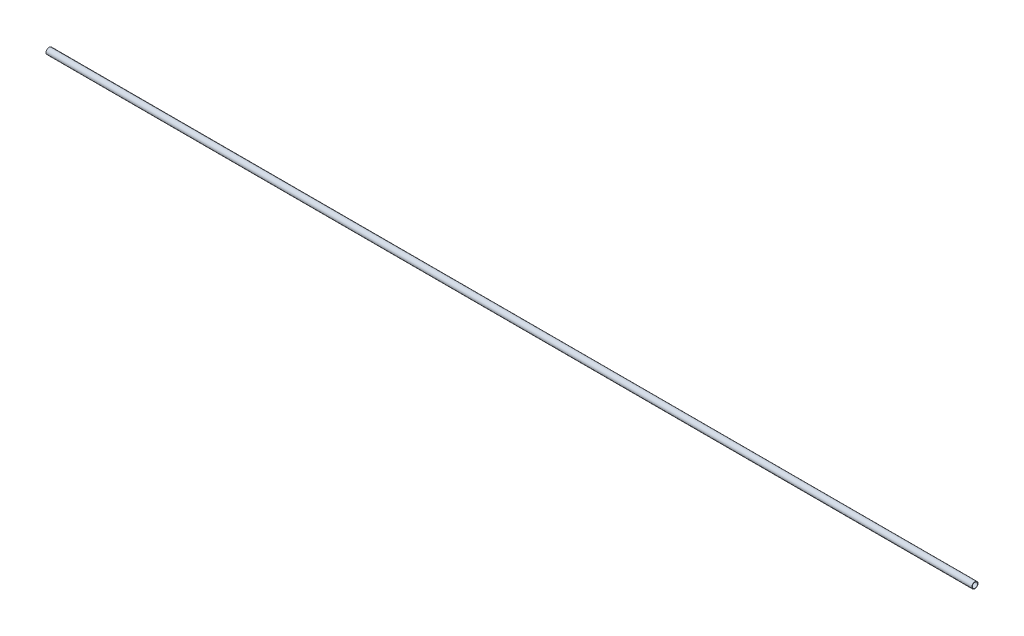
ISO-10303-21;
HEADER;
FILE_DESCRIPTION(('STEP AP214'),'2;1');
FILE_NAME('part.step','',(''),(''),'','','');
FILE_SCHEMA(('AUTOMOTIVE_DESIGN { 1 0 10303 214 1 1 1 1 }'));
ENDSEC;
DATA;
#1=APPLICATION_CONTEXT('core data for automotive mechanical design processes');
#2=APPLICATION_PROTOCOL_DEFINITION('international standard','automotive_design',2000,#1);
#3=PRODUCT_CONTEXT('',#1,'mechanical');
#4=PRODUCT('Part','Part','',(#3));
#5=PRODUCT_RELATED_PRODUCT_CATEGORY('part','',(#4));
#6=PRODUCT_DEFINITION_FORMATION('','',#4);
#7=PRODUCT_DEFINITION_CONTEXT('part definition',#1,'design');
#8=PRODUCT_DEFINITION('design','',#6,#7);
#9=PRODUCT_DEFINITION_SHAPE('','',#8);
#10=(LENGTH_UNIT() NAMED_UNIT(*) SI_UNIT(.MILLI.,.METRE.));
#11=(NAMED_UNIT(*) PLANE_ANGLE_UNIT() SI_UNIT($,.RADIAN.));
#12=(NAMED_UNIT(*) SI_UNIT($,.STERADIAN.) SOLID_ANGLE_UNIT());
#13=UNCERTAINTY_MEASURE_WITH_UNIT(LENGTH_MEASURE(1.E-05),#10,'distance_accuracy_value','');
#14=(GEOMETRIC_REPRESENTATION_CONTEXT(3) GLOBAL_UNCERTAINTY_ASSIGNED_CONTEXT((#13)) GLOBAL_UNIT_ASSIGNED_CONTEXT((#10,
#11,#12)) REPRESENTATION_CONTEXT('',''));
#15=CARTESIAN_POINT('',(0.,0.,0.));
#16=DIRECTION('',(0.,0.,1.));
#17=DIRECTION('',(1.,0.,0.));
#18=AXIS2_PLACEMENT_3D('',#15,#16,#17);
#19=CARTESIAN_POINT('',(711.2,0.,0.));
#20=DIRECTION('',(-1.,0.,0.));
#21=DIRECTION('',(0.,0.,1.));
#22=AXIS2_PLACEMENT_3D('',#19,#20,#21);
#23=CYLINDRICAL_SURFACE('',#22,2.02565);
#24=CARTESIAN_POINT('',(711.2,0.,0.));
#25=DIRECTION('',(1.,0.,0.));
#26=DIRECTION('',(0.,0.,-1.));
#27=AXIS2_PLACEMENT_3D('',#24,#25,#26);
#28=CIRCLE('',#27,2.02565);
#29=CARTESIAN_POINT('',(711.2,0.,-2.02565));
#30=VERTEX_POINT('',#29);
#31=EDGE_CURVE('E40',#30,#30,#28,.T.);
#32=ORIENTED_EDGE('',*,*,#31,.T.);
#33=EDGE_LOOP('',(#32));
#34=FACE_BOUND('',#33,.T.);
#35=CARTESIAN_POINT('',(0.,0.,0.));
#36=DIRECTION('',(1.,0.,0.));
#37=DIRECTION('',(0.,0.,-1.));
#38=AXIS2_PLACEMENT_3D('',#35,#36,#37);
#39=CIRCLE('',#38,2.02565);
#40=CARTESIAN_POINT('',(0.,0.,-2.02565));
#41=VERTEX_POINT('',#40);
#42=EDGE_CURVE('E46',#41,#41,#39,.T.);
#43=ORIENTED_EDGE('',*,*,#42,.F.);
#44=EDGE_LOOP('',(#43));
#45=FACE_BOUND('',#44,.T.);
#46=ADVANCED_FACE('F33',(#34,#45),#23,.F.);
#47=CARTESIAN_POINT('',(711.2,0.,0.));
#48=DIRECTION('',(-1.,0.,0.));
#49=DIRECTION('',(0.,0.,1.));
#50=AXIS2_PLACEMENT_3D('',#47,#48,#49);
#51=CYLINDRICAL_SURFACE('',#50,2.38125);
#52=CARTESIAN_POINT('',(711.2,0.,0.));
#53=DIRECTION('',(1.,0.,0.));
#54=DIRECTION('',(0.,0.,-1.));
#55=AXIS2_PLACEMENT_3D('',#52,#53,#54);
#56=CIRCLE('',#55,2.38125);
#57=CARTESIAN_POINT('',(711.2,0.,-2.38125));
#58=VERTEX_POINT('',#57);
#59=EDGE_CURVE('E10',#58,#58,#56,.T.);
#60=ORIENTED_EDGE('',*,*,#59,.F.);
#61=EDGE_LOOP('',(#60));
#62=FACE_BOUND('',#61,.T.);
#63=CARTESIAN_POINT('',(0.,0.,0.));
#64=DIRECTION('',(1.,0.,0.));
#65=DIRECTION('',(0.,0.,-1.));
#66=AXIS2_PLACEMENT_3D('',#63,#64,#65);
#67=CIRCLE('',#66,2.38125);
#68=CARTESIAN_POINT('',(0.,0.,-2.38125));
#69=VERTEX_POINT('',#68);
#70=EDGE_CURVE('E36',#69,#69,#67,.T.);
#71=ORIENTED_EDGE('',*,*,#70,.T.);
#72=EDGE_LOOP('',(#71));
#73=FACE_BOUND('',#72,.T.);
#74=ADVANCED_FACE('F53',(#62,#73),#51,.T.);
#75=CARTESIAN_POINT('',(711.2,0.,0.));
#76=DIRECTION('',(1.,0.,0.));
#77=DIRECTION('',(0.,0.,-1.));
#78=AXIS2_PLACEMENT_3D('',#75,#76,#77);
#79=PLANE('',#78);
#80=ORIENTED_EDGE('',*,*,#31,.F.);
#81=EDGE_LOOP('',(#80));
#82=FACE_BOUND('',#81,.T.);
#83=ORIENTED_EDGE('',*,*,#59,.T.);
#84=EDGE_LOOP('',(#83));
#85=FACE_BOUND('',#84,.T.);
#86=ADVANCED_FACE('F57',(#82,#85),#79,.T.);
#87=CARTESIAN_POINT('',(0.,0.,0.));
#88=DIRECTION('',(1.,0.,0.));
#89=DIRECTION('',(0.,0.,-1.));
#90=AXIS2_PLACEMENT_3D('',#87,#88,#89);
#91=PLANE('',#90);
#92=ORIENTED_EDGE('',*,*,#42,.T.);
#93=EDGE_LOOP('',(#92));
#94=FACE_BOUND('',#93,.T.);
#95=ORIENTED_EDGE('',*,*,#70,.F.);
#96=EDGE_LOOP('',(#95));
#97=FACE_BOUND('',#96,.T.);
#98=ADVANCED_FACE('F55',(#94,#97),#91,.F.);
#99=CLOSED_SHELL('',(#46,#74,#86,#98));
#100=MANIFOLD_SOLID_BREP('B2',#99);
#101=ADVANCED_BREP_SHAPE_REPRESENTATION('',(#18,#100),#14);
#102=SHAPE_DEFINITION_REPRESENTATION(#9,#101);
ENDSEC;
END-ISO-10303-21;
